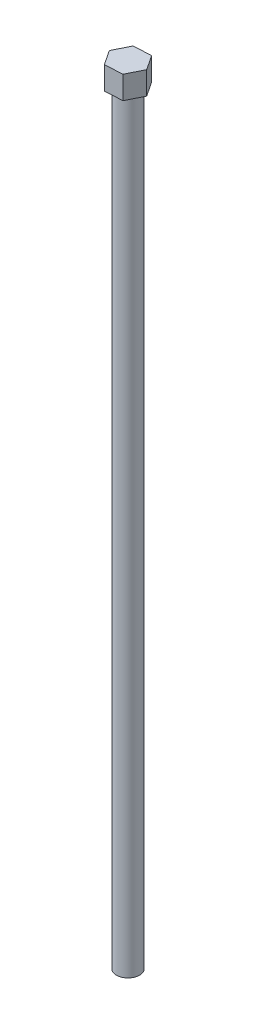
ISO-10303-21;
HEADER;
FILE_DESCRIPTION(('STEP AP214'),'2;1');
FILE_NAME('part.step','',(''),(''),'','','');
FILE_SCHEMA(('AUTOMOTIVE_DESIGN { 1 0 10303 214 1 1 1 1 }'));
ENDSEC;
DATA;
#1=APPLICATION_CONTEXT('core data for automotive mechanical design processes');
#2=APPLICATION_PROTOCOL_DEFINITION('international standard','automotive_design',2000,#1);
#3=PRODUCT_CONTEXT('',#1,'mechanical');
#4=PRODUCT('Part','Part','',(#3));
#5=PRODUCT_RELATED_PRODUCT_CATEGORY('part','',(#4));
#6=PRODUCT_DEFINITION_FORMATION('','',#4);
#7=PRODUCT_DEFINITION_CONTEXT('part definition',#1,'design');
#8=PRODUCT_DEFINITION('design','',#6,#7);
#9=PRODUCT_DEFINITION_SHAPE('','',#8);
#10=(LENGTH_UNIT() NAMED_UNIT(*) SI_UNIT(.MILLI.,.METRE.));
#11=(NAMED_UNIT(*) PLANE_ANGLE_UNIT() SI_UNIT($,.RADIAN.));
#12=(NAMED_UNIT(*) SI_UNIT($,.STERADIAN.) SOLID_ANGLE_UNIT());
#13=UNCERTAINTY_MEASURE_WITH_UNIT(LENGTH_MEASURE(1.E-05),#10,'distance_accuracy_value','');
#14=(GEOMETRIC_REPRESENTATION_CONTEXT(3) GLOBAL_UNCERTAINTY_ASSIGNED_CONTEXT((#13)) GLOBAL_UNIT_ASSIGNED_CONTEXT((#10,
#11,#12)) REPRESENTATION_CONTEXT('',''));
#15=CARTESIAN_POINT('',(0.,0.,0.));
#16=DIRECTION('',(0.,0.,1.));
#17=DIRECTION('',(1.,0.,0.));
#18=AXIS2_PLACEMENT_3D('',#15,#16,#17);
#19=CARTESIAN_POINT('',(0.,100.,0.));
#20=DIRECTION('',(0.,-1.,0.));
#21=DIRECTION('',(0.,0.,-1.));
#22=AXIS2_PLACEMENT_3D('',#19,#20,#21);
#23=CYLINDRICAL_SURFACE('',#22,1.5);
#24=CARTESIAN_POINT('',(0.,100.,0.));
#25=DIRECTION('',(0.,1.,0.));
#26=DIRECTION('',(0.,0.,1.));
#27=AXIS2_PLACEMENT_3D('',#24,#25,#26);
#28=CIRCLE('',#27,1.5);
#29=CARTESIAN_POINT('',(0.,100.,1.5));
#30=VERTEX_POINT('',#29);
#31=EDGE_CURVE('E11',#30,#30,#28,.T.);
#32=ORIENTED_EDGE('',*,*,#31,.F.);
#33=EDGE_LOOP('',(#32));
#34=FACE_BOUND('',#33,.T.);
#35=CARTESIAN_POINT('',(0.,0.,0.));
#36=DIRECTION('',(0.,1.,0.));
#37=DIRECTION('',(0.,0.,1.));
#38=AXIS2_PLACEMENT_3D('',#35,#36,#37);
#39=CIRCLE('',#38,1.5);
#40=CARTESIAN_POINT('',(0.,0.,1.5));
#41=VERTEX_POINT('',#40);
#42=EDGE_CURVE('E36',#41,#41,#39,.T.);
#43=ORIENTED_EDGE('',*,*,#42,.T.);
#44=EDGE_LOOP('',(#43));
#45=FACE_BOUND('',#44,.T.);
#46=ADVANCED_FACE('F33',(#34,#45),#23,.T.);
#47=CARTESIAN_POINT('',(0.,0.,0.));
#48=DIRECTION('',(0.,1.,0.));
#49=DIRECTION('',(0.,0.,1.));
#50=AXIS2_PLACEMENT_3D('',#47,#48,#49);
#51=PLANE('',#50);
#52=ORIENTED_EDGE('',*,*,#42,.F.);
#53=EDGE_LOOP('',(#52));
#54=FACE_BOUND('',#53,.T.);
#55=ADVANCED_FACE('F141',(#54),#51,.F.);
#56=CARTESIAN_POINT('',(-1.27205879205664,103.,-1.92748534699612));
#57=DIRECTION('',(0.894334866001464,0.,0.447398197866446));
#58=DIRECTION('',(0.447398197866446,0.,-0.894334866001464));
#59=AXIS2_PLACEMENT_3D('',#56,#57,#58);
#60=PLANE('',#59);
#61=DIRECTION('',(-0.447398197866446,0.,0.894334866001464));
#62=VECTOR('',#61,1.);
#63=CARTESIAN_POINT('',(-1.27205879205664,100.,-1.92748534699612));
#64=LINE('',#63,#62);
#65=CARTESIAN_POINT('',(-1.27205879205664,100.,-1.92748534699612));
#66=VERTEX_POINT('',#65);
#67=CARTESIAN_POINT('',(-2.30528067194922,100.,0.137892555530333));
#68=VERTEX_POINT('',#67);
#69=EDGE_CURVE('E118',#66,#68,#64,.T.);
#70=ORIENTED_EDGE('',*,*,#69,.T.);
#71=DIRECTION('',(0.,-1.,0.));
#72=VECTOR('',#71,1.);
#73=CARTESIAN_POINT('',(-2.30528067194922,103.,0.137892555530333));
#74=LINE('',#73,#72);
#75=CARTESIAN_POINT('',(-2.30528067194922,103.,0.137892555530333));
#76=VERTEX_POINT('',#75);
#77=EDGE_CURVE('E135',#76,#68,#74,.T.);
#78=ORIENTED_EDGE('',*,*,#77,.F.);
#79=DIRECTION('',(-0.447398197866446,0.,0.894334866001464));
#80=VECTOR('',#79,1.);
#81=CARTESIAN_POINT('',(-1.27205879205664,103.,-1.92748534699612));
#82=LINE('',#81,#80);
#83=CARTESIAN_POINT('',(-1.27205879205664,103.,-1.92748534699612));
#84=VERTEX_POINT('',#83);
#85=EDGE_CURVE('E128',#84,#76,#82,.T.);
#86=ORIENTED_EDGE('',*,*,#85,.F.);
#87=DIRECTION('',(0.,-1.,0.));
#88=VECTOR('',#87,1.);
#89=CARTESIAN_POINT('',(-1.27205879205664,103.,-1.92748534699612));
#90=LINE('',#89,#88);
#91=EDGE_CURVE('E114',#84,#66,#90,.T.);
#92=ORIENTED_EDGE('',*,*,#91,.T.);
#93=EDGE_LOOP('',(#70,#78,#86,#92));
#94=FACE_BOUND('',#93,.T.);
#95=ADVANCED_FACE('F143',(#94),#60,.F.);
#96=CARTESIAN_POINT('',(-2.30528067194922,103.,0.137892555530333));
#97=DIRECTION('',(0.834625637960451,0.,-0.550817614514196));
#98=DIRECTION('',(-0.550817614514196,0.,-0.834625637960451));
#99=AXIS2_PLACEMENT_3D('',#96,#97,#98);
#100=PLANE('',#99);
#101=DIRECTION('',(0.550817614514196,0.,0.834625637960451));
#102=VECTOR('',#101,1.);
#103=CARTESIAN_POINT('',(-2.30528067194922,100.,0.137892555530333));
#104=LINE('',#103,#102);
#105=CARTESIAN_POINT('',(-1.03322187989259,100.,2.06537790252645));
#106=VERTEX_POINT('',#105);
#107=EDGE_CURVE('E121',#68,#106,#104,.T.);
#108=ORIENTED_EDGE('',*,*,#107,.T.);
#109=DIRECTION('',(0.,-1.,0.));
#110=VECTOR('',#109,1.);
#111=CARTESIAN_POINT('',(-1.03322187989259,103.,2.06537790252645));
#112=LINE('',#111,#110);
#113=CARTESIAN_POINT('',(-1.03322187989259,103.,2.06537790252645));
#114=VERTEX_POINT('',#113);
#115=EDGE_CURVE('E132',#114,#106,#112,.T.);
#116=ORIENTED_EDGE('',*,*,#115,.F.);
#117=DIRECTION('',(0.550817614514196,0.,0.834625637960451));
#118=VECTOR('',#117,1.);
#119=CARTESIAN_POINT('',(-2.30528067194922,103.,0.137892555530333));
#120=LINE('',#119,#118);
#121=EDGE_CURVE('E87',#76,#114,#120,.T.);
#122=ORIENTED_EDGE('',*,*,#121,.F.);
#123=ORIENTED_EDGE('',*,*,#77,.T.);
#124=EDGE_LOOP('',(#108,#116,#122,#123));
#125=FACE_BOUND('',#124,.T.);
#126=ADVANCED_FACE('F148',(#125),#100,.F.);
#127=CARTESIAN_POINT('',(-1.03322187989259,103.,2.06537790252645));
#128=DIRECTION('',(-0.0597092280410122,0.,-0.998215812380643));
#129=DIRECTION('',(-0.998215812380643,0.,0.0597092280410122));
#130=AXIS2_PLACEMENT_3D('',#127,#128,#129);
#131=PLANE('',#130);
#132=DIRECTION('',(0.998215812380643,0.,-0.0597092280410122));
#133=VECTOR('',#132,1.);
#134=CARTESIAN_POINT('',(-1.03322187989259,100.,2.06537790252645));
#135=LINE('',#134,#133);
#136=CARTESIAN_POINT('',(1.27205879205663,100.,1.92748534699612));
#137=VERTEX_POINT('',#136);
#138=EDGE_CURVE('E123',#106,#137,#135,.T.);
#139=ORIENTED_EDGE('',*,*,#138,.T.);
#140=DIRECTION('',(0.,-1.,0.));
#141=VECTOR('',#140,1.);
#142=CARTESIAN_POINT('',(1.27205879205663,103.,1.92748534699612));
#143=LINE('',#142,#141);
#144=CARTESIAN_POINT('',(1.27205879205663,103.,1.92748534699612));
#145=VERTEX_POINT('',#144);
#146=EDGE_CURVE('E109',#145,#137,#143,.T.);
#147=ORIENTED_EDGE('',*,*,#146,.F.);
#148=DIRECTION('',(0.998215812380643,0.,-0.0597092280410122));
#149=VECTOR('',#148,1.);
#150=CARTESIAN_POINT('',(-1.03322187989259,103.,2.06537790252645));
#151=LINE('',#150,#149);
#152=EDGE_CURVE('E100',#114,#145,#151,.T.);
#153=ORIENTED_EDGE('',*,*,#152,.F.);
#154=ORIENTED_EDGE('',*,*,#115,.T.);
#155=EDGE_LOOP('',(#139,#147,#153,#154));
#156=FACE_BOUND('',#155,.T.);
#157=ADVANCED_FACE('F155',(#156),#131,.F.);
#158=CARTESIAN_POINT('',(1.27205879205663,103.,1.92748534699612));
#159=DIRECTION('',(-0.894334866001464,0.,-0.447398197866446));
#160=DIRECTION('',(-0.447398197866446,0.,0.894334866001464));
#161=AXIS2_PLACEMENT_3D('',#158,#159,#160);
#162=PLANE('',#161);
#163=DIRECTION('',(0.447398197866446,0.,-0.894334866001464));
#164=VECTOR('',#163,1.);
#165=CARTESIAN_POINT('',(1.27205879205663,100.,1.92748534699612));
#166=LINE('',#165,#164);
#167=CARTESIAN_POINT('',(2.30528067194922,100.,-0.137892555530333));
#168=VERTEX_POINT('',#167);
#169=EDGE_CURVE('E108',#137,#168,#166,.T.);
#170=ORIENTED_EDGE('',*,*,#169,.T.);
#171=DIRECTION('',(0.,-1.,0.));
#172=VECTOR('',#171,1.);
#173=CARTESIAN_POINT('',(2.30528067194922,103.,-0.137892555530333));
#174=LINE('',#173,#172);
#175=CARTESIAN_POINT('',(2.30528067194922,103.,-0.137892555530333));
#176=VERTEX_POINT('',#175);
#177=EDGE_CURVE('E105',#176,#168,#174,.T.);
#178=ORIENTED_EDGE('',*,*,#177,.F.);
#179=DIRECTION('',(0.447398197866446,0.,-0.894334866001464));
#180=VECTOR('',#179,1.);
#181=CARTESIAN_POINT('',(1.27205879205663,103.,1.92748534699612));
#182=LINE('',#181,#180);
#183=EDGE_CURVE('E94',#145,#176,#182,.T.);
#184=ORIENTED_EDGE('',*,*,#183,.F.);
#185=ORIENTED_EDGE('',*,*,#146,.T.);
#186=EDGE_LOOP('',(#170,#178,#184,#185));
#187=FACE_BOUND('',#186,.T.);
#188=ADVANCED_FACE('F106',(#187),#162,.F.);
#189=CARTESIAN_POINT('',(2.30528067194922,103.,-0.137892555530333));
#190=DIRECTION('',(-0.834625637960451,0.,0.550817614514196));
#191=DIRECTION('',(0.550817614514196,0.,0.834625637960451));
#192=AXIS2_PLACEMENT_3D('',#189,#190,#191);
#193=PLANE('',#192);
#194=DIRECTION('',(-0.550817614514196,0.,-0.834625637960451));
#195=VECTOR('',#194,1.);
#196=CARTESIAN_POINT('',(2.30528067194922,100.,-0.137892555530333));
#197=LINE('',#196,#195);
#198=CARTESIAN_POINT('',(1.03322187989259,100.,-2.06537790252645));
#199=VERTEX_POINT('',#198);
#200=EDGE_CURVE('E72',#168,#199,#197,.T.);
#201=ORIENTED_EDGE('',*,*,#200,.T.);
#202=DIRECTION('',(0.,-1.,0.));
#203=VECTOR('',#202,1.);
#204=CARTESIAN_POINT('',(1.03322187989259,103.,-2.06537790252645));
#205=LINE('',#204,#203);
#206=CARTESIAN_POINT('',(1.03322187989259,103.,-2.06537790252645));
#207=VERTEX_POINT('',#206);
#208=EDGE_CURVE('E110',#207,#199,#205,.T.);
#209=ORIENTED_EDGE('',*,*,#208,.F.);
#210=DIRECTION('',(-0.550817614514196,0.,-0.834625637960451));
#211=VECTOR('',#210,1.);
#212=CARTESIAN_POINT('',(2.30528067194922,103.,-0.137892555530333));
#213=LINE('',#212,#211);
#214=EDGE_CURVE('E98',#176,#207,#213,.T.);
#215=ORIENTED_EDGE('',*,*,#214,.F.);
#216=ORIENTED_EDGE('',*,*,#177,.T.);
#217=EDGE_LOOP('',(#201,#209,#215,#216));
#218=FACE_BOUND('',#217,.T.);
#219=ADVANCED_FACE('F112',(#218),#193,.F.);
#220=CARTESIAN_POINT('',(1.03322187989259,103.,-2.06537790252645));
#221=DIRECTION('',(0.0597092280410121,0.,0.998215812380643));
#222=DIRECTION('',(0.998215812380643,0.,-0.0597092280410121));
#223=AXIS2_PLACEMENT_3D('',#220,#221,#222);
#224=PLANE('',#223);
#225=DIRECTION('',(-0.998215812380643,0.,0.0597092280410121));
#226=VECTOR('',#225,1.);
#227=CARTESIAN_POINT('',(1.03322187989259,100.,-2.06537790252645));
#228=LINE('',#227,#226);
#229=EDGE_CURVE('E78',#199,#66,#228,.T.);
#230=ORIENTED_EDGE('',*,*,#229,.T.);
#231=ORIENTED_EDGE('',*,*,#91,.F.);
#232=DIRECTION('',(-0.998215812380643,0.,0.0597092280410121));
#233=VECTOR('',#232,1.);
#234=CARTESIAN_POINT('',(1.03322187989259,103.,-2.06537790252645));
#235=LINE('',#234,#233);
#236=EDGE_CURVE('E49',#207,#84,#235,.T.);
#237=ORIENTED_EDGE('',*,*,#236,.F.);
#238=ORIENTED_EDGE('',*,*,#208,.T.);
#239=EDGE_LOOP('',(#230,#231,#237,#238));
#240=FACE_BOUND('',#239,.T.);
#241=ADVANCED_FACE('F163',(#240),#224,.F.);
#242=CARTESIAN_POINT('',(0.,103.,0.));
#243=DIRECTION('',(0.,1.,0.));
#244=DIRECTION('',(0.,0.,1.));
#245=AXIS2_PLACEMENT_3D('',#242,#243,#244);
#246=PLANE('',#245);
#247=ORIENTED_EDGE('',*,*,#85,.T.);
#248=ORIENTED_EDGE('',*,*,#121,.T.);
#249=ORIENTED_EDGE('',*,*,#152,.T.);
#250=ORIENTED_EDGE('',*,*,#183,.T.);
#251=ORIENTED_EDGE('',*,*,#214,.T.);
#252=ORIENTED_EDGE('',*,*,#236,.T.);
#253=EDGE_LOOP('',(#247,#248,#249,#250,#251,#252));
#254=FACE_BOUND('',#253,.T.);
#255=ADVANCED_FACE('F96',(#254),#246,.T.);
#256=CARTESIAN_POINT('',(0.,100.,0.));
#257=DIRECTION('',(0.,1.,0.));
#258=DIRECTION('',(0.,0.,1.));
#259=AXIS2_PLACEMENT_3D('',#256,#257,#258);
#260=PLANE('',#259);
#261=ORIENTED_EDGE('',*,*,#31,.T.);
#262=EDGE_LOOP('',(#261));
#263=FACE_BOUND('',#262,.T.);
#264=ORIENTED_EDGE('',*,*,#69,.F.);
#265=ORIENTED_EDGE('',*,*,#229,.F.);
#266=ORIENTED_EDGE('',*,*,#200,.F.);
#267=ORIENTED_EDGE('',*,*,#169,.F.);
#268=ORIENTED_EDGE('',*,*,#138,.F.);
#269=ORIENTED_EDGE('',*,*,#107,.F.);
#270=EDGE_LOOP('',(#264,#265,#266,#267,#268,#269));
#271=FACE_BOUND('',#270,.T.);
#272=ADVANCED_FACE('F166',(#263,#271),#260,.F.);
#273=CLOSED_SHELL('',(#46,#55,#95,#126,#157,#188,#219,#241,#255,#272));
#274=MANIFOLD_SOLID_BREP('B2',#273);
#275=ADVANCED_BREP_SHAPE_REPRESENTATION('',(#18,#274),#14);
#276=SHAPE_DEFINITION_REPRESENTATION(#9,#275);
ENDSEC;
END-ISO-10303-21;
